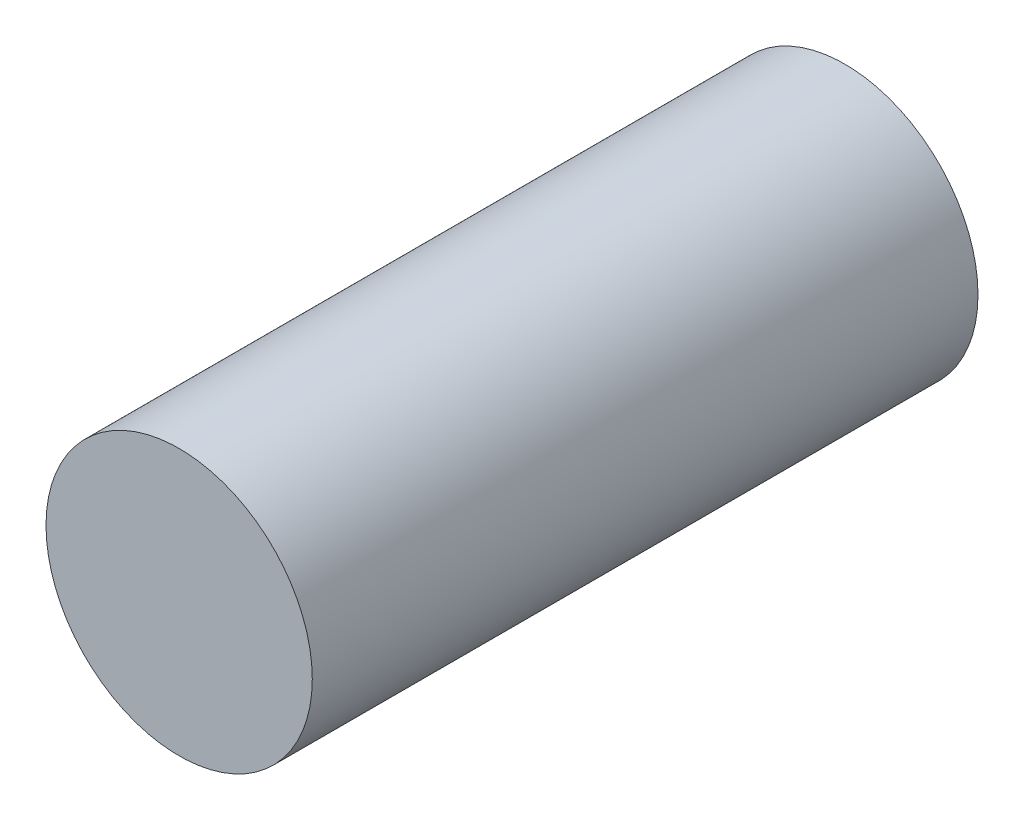
ISO-10303-21;
HEADER;
FILE_DESCRIPTION(('STEP AP214'),'2;1');
FILE_NAME('part.step','',(''),(''),'','','');
FILE_SCHEMA(('AUTOMOTIVE_DESIGN { 1 0 10303 214 1 1 1 1 }'));
ENDSEC;
DATA;
#1=APPLICATION_CONTEXT('core data for automotive mechanical design processes');
#2=APPLICATION_PROTOCOL_DEFINITION('international standard','automotive_design',2000,#1);
#3=PRODUCT_CONTEXT('',#1,'mechanical');
#4=PRODUCT('Part','Part','',(#3));
#5=PRODUCT_RELATED_PRODUCT_CATEGORY('part','',(#4));
#6=PRODUCT_DEFINITION_FORMATION('','',#4);
#7=PRODUCT_DEFINITION_CONTEXT('part definition',#1,'design');
#8=PRODUCT_DEFINITION('design','',#6,#7);
#9=PRODUCT_DEFINITION_SHAPE('','',#8);
#10=(LENGTH_UNIT() NAMED_UNIT(*) SI_UNIT(.MILLI.,.METRE.));
#11=(NAMED_UNIT(*) PLANE_ANGLE_UNIT() SI_UNIT($,.RADIAN.));
#12=(NAMED_UNIT(*) SI_UNIT($,.STERADIAN.) SOLID_ANGLE_UNIT());
#13=UNCERTAINTY_MEASURE_WITH_UNIT(LENGTH_MEASURE(1.E-05),#10,'distance_accuracy_value','');
#14=(GEOMETRIC_REPRESENTATION_CONTEXT(3) GLOBAL_UNCERTAINTY_ASSIGNED_CONTEXT((#13)) GLOBAL_UNIT_ASSIGNED_CONTEXT((#10,
#11,#12)) REPRESENTATION_CONTEXT('',''));
#15=CARTESIAN_POINT('',(0.,0.,0.));
#16=DIRECTION('',(0.,0.,1.));
#17=DIRECTION('',(1.,0.,0.));
#18=AXIS2_PLACEMENT_3D('',#15,#16,#17);
#19=CARTESIAN_POINT('',(0.,0.,31.75));
#20=DIRECTION('',(0.,0.,-1.));
#21=DIRECTION('',(-1.,0.,0.));
#22=AXIS2_PLACEMENT_3D('',#19,#20,#21);
#23=CYLINDRICAL_SURFACE('',#22,6.35);
#24=CARTESIAN_POINT('',(0.,0.,31.75));
#25=DIRECTION('',(0.,0.,1.));
#26=DIRECTION('',(1.,0.,0.));
#27=AXIS2_PLACEMENT_3D('',#24,#25,#26);
#28=CIRCLE('',#27,6.35);
#29=CARTESIAN_POINT('',(6.35,0.,31.75));
#30=VERTEX_POINT('',#29);
#31=EDGE_CURVE('E10',#30,#30,#28,.T.);
#32=ORIENTED_EDGE('',*,*,#31,.F.);
#33=EDGE_LOOP('',(#32));
#34=FACE_BOUND('',#33,.T.);
#35=CARTESIAN_POINT('',(0.,0.,0.));
#36=DIRECTION('',(0.,0.,1.));
#37=DIRECTION('',(1.,0.,0.));
#38=AXIS2_PLACEMENT_3D('',#35,#36,#37);
#39=CIRCLE('',#38,6.35);
#40=CARTESIAN_POINT('',(6.35,0.,0.));
#41=VERTEX_POINT('',#40);
#42=EDGE_CURVE('E35',#41,#41,#39,.T.);
#43=ORIENTED_EDGE('',*,*,#42,.T.);
#44=EDGE_LOOP('',(#43));
#45=FACE_BOUND('',#44,.T.);
#46=ADVANCED_FACE('F32',(#34,#45),#23,.T.);
#47=CARTESIAN_POINT('',(0.,0.,31.75));
#48=DIRECTION('',(0.,0.,1.));
#49=DIRECTION('',(1.,0.,0.));
#50=AXIS2_PLACEMENT_3D('',#47,#48,#49);
#51=PLANE('',#50);
#52=ORIENTED_EDGE('',*,*,#31,.T.);
#53=EDGE_LOOP('',(#52));
#54=FACE_BOUND('',#53,.T.);
#55=ADVANCED_FACE('F47',(#54),#51,.T.);
#56=CARTESIAN_POINT('',(0.,0.,0.));
#57=DIRECTION('',(0.,0.,1.));
#58=DIRECTION('',(1.,0.,0.));
#59=AXIS2_PLACEMENT_3D('',#56,#57,#58);
#60=PLANE('',#59);
#61=ORIENTED_EDGE('',*,*,#42,.F.);
#62=EDGE_LOOP('',(#61));
#63=FACE_BOUND('',#62,.T.);
#64=ADVANCED_FACE('F45',(#63),#60,.F.);
#65=CLOSED_SHELL('',(#46,#55,#64));
#66=MANIFOLD_SOLID_BREP('B2',#65);
#67=ADVANCED_BREP_SHAPE_REPRESENTATION('',(#18,#66),#14);
#68=SHAPE_DEFINITION_REPRESENTATION(#9,#67);
ENDSEC;
END-ISO-10303-21;
